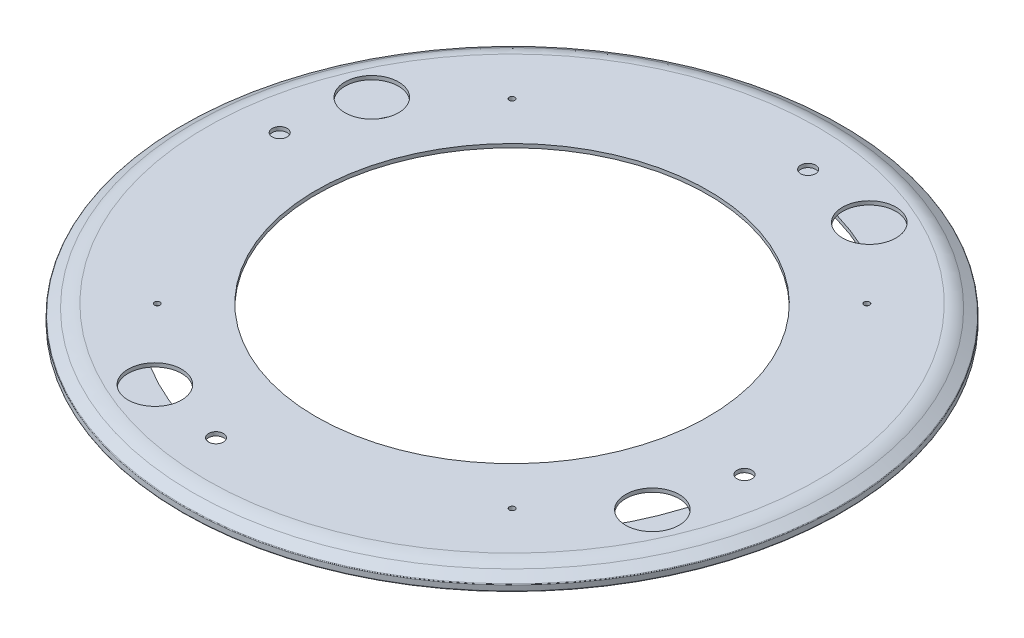
ISO-10303-21;
HEADER;
FILE_DESCRIPTION(('STEP AP214'),'2;1');
FILE_NAME('part.step','',(''),(''),'','','');
FILE_SCHEMA(('AUTOMOTIVE_DESIGN { 1 0 10303 214 1 1 1 1 }'));
ENDSEC;
DATA;
#1=APPLICATION_CONTEXT('core data for automotive mechanical design processes');
#2=APPLICATION_PROTOCOL_DEFINITION('international standard','automotive_design',2000,#1);
#3=PRODUCT_CONTEXT('',#1,'mechanical');
#4=PRODUCT('Part','Part','',(#3));
#5=PRODUCT_RELATED_PRODUCT_CATEGORY('part','',(#4));
#6=PRODUCT_DEFINITION_FORMATION('','',#4);
#7=PRODUCT_DEFINITION_CONTEXT('part definition',#1,'design');
#8=PRODUCT_DEFINITION('design','',#6,#7);
#9=PRODUCT_DEFINITION_SHAPE('','',#8);
#10=(LENGTH_UNIT() NAMED_UNIT(*) SI_UNIT(.MILLI.,.METRE.));
#11=(NAMED_UNIT(*) PLANE_ANGLE_UNIT() SI_UNIT($,.RADIAN.));
#12=(NAMED_UNIT(*) SI_UNIT($,.STERADIAN.) SOLID_ANGLE_UNIT());
#13=UNCERTAINTY_MEASURE_WITH_UNIT(LENGTH_MEASURE(1.E-05),#10,'distance_accuracy_value','');
#14=(GEOMETRIC_REPRESENTATION_CONTEXT(3) GLOBAL_UNCERTAINTY_ASSIGNED_CONTEXT((#13)) GLOBAL_UNIT_ASSIGNED_CONTEXT((#10,
#11,#12)) REPRESENTATION_CONTEXT('',''));
#15=CARTESIAN_POINT('',(0.,0.,0.));
#16=DIRECTION('',(0.,0.,1.));
#17=DIRECTION('',(1.,0.,0.));
#18=AXIS2_PLACEMENT_3D('',#15,#16,#17);
#19=CARTESIAN_POINT('',(0.,0.,0.));
#20=DIRECTION('',(0.,1.,0.));
#21=DIRECTION('',(0.,0.,1.));
#22=AXIS2_PLACEMENT_3D('',#19,#20,#21);
#23=CYLINDRICAL_SURFACE('',#22,140.5);
#24=CARTESIAN_POINT('',(0.,0.,0.));
#25=DIRECTION('',(0.,1.,0.));
#26=DIRECTION('',(0.,0.,1.));
#27=AXIS2_PLACEMENT_3D('',#24,#25,#26);
#28=CIRCLE('',#27,140.5);
#29=CARTESIAN_POINT('',(0.,0.,140.5));
#30=VERTEX_POINT('',#29);
#31=EDGE_CURVE('E108',#30,#30,#28,.T.);
#32=ORIENTED_EDGE('',*,*,#31,.F.);
#33=EDGE_LOOP('',(#32));
#34=FACE_BOUND('',#33,.T.);
#35=CARTESIAN_POINT('',(0.,2.,0.));
#36=DIRECTION('',(0.,1.,0.));
#37=DIRECTION('',(0.,0.,1.));
#38=AXIS2_PLACEMENT_3D('',#35,#36,#37);
#39=CIRCLE('',#38,140.5);
#40=CARTESIAN_POINT('',(0.,2.,140.5));
#41=VERTEX_POINT('',#40);
#42=EDGE_CURVE('E10',#41,#41,#39,.T.);
#43=ORIENTED_EDGE('',*,*,#42,.T.);
#44=EDGE_LOOP('',(#43));
#45=FACE_BOUND('',#44,.T.);
#46=ADVANCED_FACE('F49',(#34,#45),#23,.F.);
#47=CARTESIAN_POINT('',(140.5,2.,0.));
#48=DIRECTION('',(0.,-1.,0.));
#49=DIRECTION('',(0.,0.,-1.));
#50=AXIS2_PLACEMENT_3D('',#47,#48,#49);
#51=PLANE('',#50);
#52=CARTESIAN_POINT('',(-103.5,2.,-103.5));
#53=DIRECTION('',(0.,-1.,0.));
#54=DIRECTION('',(0.,0.,-1.));
#55=AXIS2_PLACEMENT_3D('',#52,#53,#54);
#56=CIRCLE('',#55,2.5);
#57=CARTESIAN_POINT('',(-103.5,2.,-106.));
#58=VERTEX_POINT('',#57);
#59=EDGE_CURVE('E185',#58,#58,#56,.T.);
#60=ORIENTED_EDGE('',*,*,#59,.T.);
#61=EDGE_LOOP('',(#60));
#62=FACE_BOUND('',#61,.T.);
#63=CARTESIAN_POINT('',(103.5,2.,-103.5));
#64=DIRECTION('',(0.,-1.,0.));
#65=DIRECTION('',(0.,0.,-1.));
#66=AXIS2_PLACEMENT_3D('',#63,#64,#65);
#67=CIRCLE('',#66,2.5);
#68=CARTESIAN_POINT('',(103.5,2.,-106.));
#69=VERTEX_POINT('',#68);
#70=EDGE_CURVE('E194',#69,#69,#67,.T.);
#71=ORIENTED_EDGE('',*,*,#70,.T.);
#72=EDGE_LOOP('',(#71));
#73=FACE_BOUND('',#72,.T.);
#74=CARTESIAN_POINT('',(103.5,2.,103.5));
#75=DIRECTION('',(0.,-1.,0.));
#76=DIRECTION('',(0.,0.,-1.));
#77=AXIS2_PLACEMENT_3D('',#74,#75,#76);
#78=CIRCLE('',#77,2.5);
#79=CARTESIAN_POINT('',(103.5,2.,101.));
#80=VERTEX_POINT('',#79);
#81=EDGE_CURVE('E202',#80,#80,#78,.T.);
#82=ORIENTED_EDGE('',*,*,#81,.T.);
#83=EDGE_LOOP('',(#82));
#84=FACE_BOUND('',#83,.T.);
#85=CARTESIAN_POINT('',(-103.5,2.,103.5));
#86=DIRECTION('',(0.,-1.,0.));
#87=DIRECTION('',(0.,0.,-1.));
#88=AXIS2_PLACEMENT_3D('',#85,#86,#87);
#89=CIRCLE('',#88,2.5);
#90=CARTESIAN_POINT('',(-103.5,2.,101.));
#91=VERTEX_POINT('',#90);
#92=EDGE_CURVE('E166',#91,#91,#89,.T.);
#93=ORIENTED_EDGE('',*,*,#92,.T.);
#94=EDGE_LOOP('',(#93));
#95=FACE_BOUND('',#94,.T.);
#96=ORIENTED_EDGE('',*,*,#42,.F.);
#97=EDGE_LOOP('',(#96));
#98=FACE_BOUND('',#97,.T.);
#99=CARTESIAN_POINT('',(0.,2.,0.));
#100=DIRECTION('',(0.,1.,0.));
#101=DIRECTION('',(0.,0.,1.));
#102=AXIS2_PLACEMENT_3D('',#99,#100,#101);
#103=CIRCLE('',#102,174.5);
#104=CARTESIAN_POINT('',(0.,2.,174.5));
#105=VERTEX_POINT('',#104);
#106=EDGE_CURVE('E56',#105,#105,#103,.T.);
#107=ORIENTED_EDGE('',*,*,#106,.T.);
#108=EDGE_LOOP('',(#107));
#109=FACE_BOUND('',#108,.T.);
#110=ADVANCED_FACE('F311',(#62,#73,#84,#95,#98,#109),#51,.F.);
#111=CARTESIAN_POINT('',(0.,0.,0.));
#112=DIRECTION('',(0.,1.,0.));
#113=DIRECTION('',(0.,0.,1.));
#114=AXIS2_PLACEMENT_3D('',#111,#112,#113);
#115=CYLINDRICAL_SURFACE('',#114,174.5);
#116=ORIENTED_EDGE('',*,*,#106,.F.);
#117=EDGE_LOOP('',(#116));
#118=FACE_BOUND('',#117,.T.);
#119=CARTESIAN_POINT('',(0.,2.65641360820091,0.));
#120=DIRECTION('',(0.,1.,0.));
#121=DIRECTION('',(0.,0.,1.));
#122=AXIS2_PLACEMENT_3D('',#119,#120,#121);
#123=CIRCLE('',#122,174.5);
#124=CARTESIAN_POINT('',(0.,2.65641360820091,174.5));
#125=VERTEX_POINT('',#124);
#126=EDGE_CURVE('E61',#125,#125,#123,.T.);
#127=ORIENTED_EDGE('',*,*,#126,.T.);
#128=EDGE_LOOP('',(#127));
#129=FACE_BOUND('',#128,.T.);
#130=ADVANCED_FACE('F315',(#118,#129),#115,.F.);
#131=CARTESIAN_POINT('',(0.,6.4390845528927,0.));
#132=DIRECTION('',(0.,-1.,0.));
#133=DIRECTION('',(0.,0.,-1.));
#134=AXIS2_PLACEMENT_3D('',#131,#132,#133);
#135=CONICAL_SURFACE('',#134,168.096314471535,1.03724151687825);
#136=ORIENTED_EDGE('',*,*,#126,.F.);
#137=EDGE_LOOP('',(#136));
#138=FACE_BOUND('',#137,.T.);
#139=CARTESIAN_POINT('',(0.,6.4390845528927,0.));
#140=DIRECTION('',(0.,1.,0.));
#141=DIRECTION('',(0.,0.,1.));
#142=AXIS2_PLACEMENT_3D('',#139,#140,#141);
#143=CIRCLE('',#142,168.096314471535);
#144=CARTESIAN_POINT('',(0.,6.4390845528927,168.096314471535));
#145=VERTEX_POINT('',#144);
#146=EDGE_CURVE('E66',#145,#145,#143,.T.);
#147=ORIENTED_EDGE('',*,*,#146,.T.);
#148=EDGE_LOOP('',(#147));
#149=FACE_BOUND('',#148,.T.);
#150=ADVANCED_FACE('F320',(#138,#149),#135,.F.);
#151=CARTESIAN_POINT('',(0.,-10.6274641766562,0.));
#152=DIRECTION('',(0.,1.,0.));
#153=DIRECTION('',(0.,0.,1.));
#154=AXIS2_PLACEMENT_3D('',#151,#152,#153);
#155=TOROIDAL_SURFACE('',#154,163.68491925446,17.6274641766562);
#156=ORIENTED_EDGE('',*,*,#146,.F.);
#157=EDGE_LOOP('',(#156));
#158=FACE_BOUND('',#157,.T.);
#159=CARTESIAN_POINT('',(0.,7.,0.));
#160=DIRECTION('',(0.,1.,0.));
#161=DIRECTION('',(0.,0.,1.));
#162=AXIS2_PLACEMENT_3D('',#159,#160,#161);
#163=CIRCLE('',#162,163.68491925446);
#164=CARTESIAN_POINT('',(0.,7.,163.68491925446));
#165=VERTEX_POINT('',#164);
#166=EDGE_CURVE('E72',#165,#165,#163,.T.);
#167=ORIENTED_EDGE('',*,*,#166,.T.);
#168=EDGE_LOOP('',(#167));
#169=FACE_BOUND('',#168,.T.);
#170=ADVANCED_FACE('F327',(#158,#169),#155,.F.);
#171=CARTESIAN_POINT('',(105.,7.,0.));
#172=DIRECTION('',(0.,1.,0.));
#173=DIRECTION('',(0.,0.,1.));
#174=AXIS2_PLACEMENT_3D('',#171,#172,#173);
#175=PLANE('',#174);
#176=CARTESIAN_POINT('',(-95.,7.,95.));
#177=DIRECTION('',(0.,1.,0.));
#178=DIRECTION('',(0.,0.,1.));
#179=AXIS2_PLACEMENT_3D('',#176,#177,#178);
#180=CIRCLE('',#179,1.5);
#181=CARTESIAN_POINT('',(-95.,7.,96.5));
#182=VERTEX_POINT('',#181);
#183=EDGE_CURVE('E190',#182,#182,#180,.T.);
#184=ORIENTED_EDGE('',*,*,#183,.T.);
#185=EDGE_LOOP('',(#184));
#186=FACE_BOUND('',#185,.T.);
#187=CARTESIAN_POINT('',(95.,7.,95.));
#188=DIRECTION('',(0.,1.,0.));
#189=DIRECTION('',(0.,0.,1.));
#190=AXIS2_PLACEMENT_3D('',#187,#188,#189);
#191=CIRCLE('',#190,1.5);
#192=CARTESIAN_POINT('',(95.,7.,96.5));
#193=VERTEX_POINT('',#192);
#194=EDGE_CURVE('E212',#193,#193,#191,.T.);
#195=ORIENTED_EDGE('',*,*,#194,.T.);
#196=EDGE_LOOP('',(#195));
#197=FACE_BOUND('',#196,.T.);
#198=CARTESIAN_POINT('',(95.,7.,-95.));
#199=DIRECTION('',(0.,1.,0.));
#200=DIRECTION('',(0.,0.,1.));
#201=AXIS2_PLACEMENT_3D('',#198,#199,#200);
#202=CIRCLE('',#201,1.5);
#203=CARTESIAN_POINT('',(95.,7.,-93.5));
#204=VERTEX_POINT('',#203);
#205=EDGE_CURVE('E216',#204,#204,#202,.T.);
#206=ORIENTED_EDGE('',*,*,#205,.T.);
#207=EDGE_LOOP('',(#206));
#208=FACE_BOUND('',#207,.T.);
#209=CARTESIAN_POINT('',(-95.,7.,-95.));
#210=DIRECTION('',(0.,1.,0.));
#211=DIRECTION('',(0.,0.,1.));
#212=AXIS2_PLACEMENT_3D('',#209,#210,#211);
#213=CIRCLE('',#212,1.5);
#214=CARTESIAN_POINT('',(-95.,7.,-93.5));
#215=VERTEX_POINT('',#214);
#216=EDGE_CURVE('E220',#215,#215,#213,.T.);
#217=ORIENTED_EDGE('',*,*,#216,.T.);
#218=EDGE_LOOP('',(#217));
#219=FACE_BOUND('',#218,.T.);
#220=CARTESIAN_POINT('',(17.0534925476215,7.,-141.497897624813));
#221=DIRECTION('',(0.,1.,0.));
#222=DIRECTION('',(0.,0.,1.));
#223=AXIS2_PLACEMENT_3D('',#220,#221,#222);
#224=CIRCLE('',#223,3.99999999999332);
#225=CARTESIAN_POINT('',(17.0534925476215,7.,-137.49789762482));
#226=VERTEX_POINT('',#225);
#227=EDGE_CURVE('E134',#226,#226,#224,.T.);
#228=ORIENTED_EDGE('',*,*,#227,.T.);
#229=EDGE_LOOP('',(#228));
#230=FACE_BOUND('',#229,.T.);
#231=CARTESIAN_POINT('',(141.497897624818,7.,17.053492547618));
#232=DIRECTION('',(0.,1.,0.));
#233=DIRECTION('',(0.,0.,1.));
#234=AXIS2_PLACEMENT_3D('',#231,#232,#233);
#235=CIRCLE('',#234,3.99999999999576);
#236=CARTESIAN_POINT('',(141.497897624818,7.,21.0534925476138));
#237=VERTEX_POINT('',#236);
#238=EDGE_CURVE('E148',#237,#237,#235,.T.);
#239=ORIENTED_EDGE('',*,*,#238,.T.);
#240=EDGE_LOOP('',(#239));
#241=FACE_BOUND('',#240,.T.);
#242=CARTESIAN_POINT('',(-17.0534925476135,7.,141.497897624814));
#243=DIRECTION('',(0.,1.,0.));
#244=DIRECTION('',(0.,0.,1.));
#245=AXIS2_PLACEMENT_3D('',#242,#243,#244);
#246=CIRCLE('',#245,4.00000000000157);
#247=CARTESIAN_POINT('',(-17.0534925476135,7.,145.497897624816));
#248=VERTEX_POINT('',#247);
#249=EDGE_CURVE('E152',#248,#248,#246,.T.);
#250=ORIENTED_EDGE('',*,*,#249,.T.);
#251=EDGE_LOOP('',(#250));
#252=FACE_BOUND('',#251,.T.);
#253=CARTESIAN_POINT('',(-141.49789762481,7.,-17.053492547617));
#254=DIRECTION('',(0.,1.,0.));
#255=DIRECTION('',(0.,0.,1.));
#256=AXIS2_PLACEMENT_3D('',#253,#254,#255);
#257=CIRCLE('',#256,4.);
#258=CARTESIAN_POINT('',(-141.49789762481,7.,-13.053492547617));
#259=VERTEX_POINT('',#258);
#260=EDGE_CURVE('E156',#259,#259,#257,.T.);
#261=ORIENTED_EDGE('',*,*,#260,.T.);
#262=EDGE_LOOP('',(#261));
#263=FACE_BOUND('',#262,.T.);
#264=CARTESIAN_POINT('',(58.0816814125634,7.,-133.219094668485));
#265=DIRECTION('',(0.,1.,0.));
#266=DIRECTION('',(0.,0.,1.));
#267=AXIS2_PLACEMENT_3D('',#264,#265,#266);
#268=CIRCLE('',#267,14.3252860119552);
#269=CARTESIAN_POINT('',(58.0816814125634,7.,-118.893808656529));
#270=VERTEX_POINT('',#269);
#271=EDGE_CURVE('E112',#270,#270,#268,.T.);
#272=ORIENTED_EDGE('',*,*,#271,.T.);
#273=EDGE_LOOP('',(#272));
#274=FACE_BOUND('',#273,.T.);
#275=CARTESIAN_POINT('',(133.21909466849,7.,58.0816814125614));
#276=DIRECTION('',(0.,1.,0.));
#277=DIRECTION('',(0.,0.,1.));
#278=AXIS2_PLACEMENT_3D('',#275,#276,#277);
#279=CIRCLE('',#278,14.325286011956);
#280=CARTESIAN_POINT('',(133.21909466849,7.,72.4069674245174));
#281=VERTEX_POINT('',#280);
#282=EDGE_CURVE('E116',#281,#281,#279,.T.);
#283=ORIENTED_EDGE('',*,*,#282,.T.);
#284=EDGE_LOOP('',(#283));
#285=FACE_BOUND('',#284,.T.);
#286=CARTESIAN_POINT('',(-58.081681412556,7.,133.219094668488));
#287=DIRECTION('',(0.,1.,0.));
#288=DIRECTION('',(0.,0.,1.));
#289=AXIS2_PLACEMENT_3D('',#286,#287,#288);
#290=CIRCLE('',#289,14.3252860119621);
#291=CARTESIAN_POINT('',(-58.081681412556,7.,147.54438068045));
#292=VERTEX_POINT('',#291);
#293=EDGE_CURVE('E120',#292,#292,#290,.T.);
#294=ORIENTED_EDGE('',*,*,#293,.T.);
#295=EDGE_LOOP('',(#294));
#296=FACE_BOUND('',#295,.T.);
#297=CARTESIAN_POINT('',(-133.219094668482,7.,-58.081681412558));
#298=DIRECTION('',(0.,1.,0.));
#299=DIRECTION('',(0.,0.,1.));
#300=AXIS2_PLACEMENT_3D('',#297,#298,#299);
#301=CIRCLE('',#300,14.3252860119621);
#302=CARTESIAN_POINT('',(-133.219094668482,7.,-43.7563954005959));
#303=VERTEX_POINT('',#302);
#304=EDGE_CURVE('E124',#303,#303,#301,.T.);
#305=ORIENTED_EDGE('',*,*,#304,.T.);
#306=EDGE_LOOP('',(#305));
#307=FACE_BOUND('',#306,.T.);
#308=ORIENTED_EDGE('',*,*,#166,.F.);
#309=EDGE_LOOP('',(#308));
#310=FACE_BOUND('',#309,.T.);
#311=CARTESIAN_POINT('',(0.,7.,0.));
#312=DIRECTION('',(0.,1.,0.));
#313=DIRECTION('',(0.,0.,1.));
#314=AXIS2_PLACEMENT_3D('',#311,#312,#313);
#315=CIRCLE('',#314,105.);
#316=CARTESIAN_POINT('',(0.,7.,105.));
#317=VERTEX_POINT('',#316);
#318=EDGE_CURVE('E76',#317,#317,#315,.T.);
#319=ORIENTED_EDGE('',*,*,#318,.T.);
#320=EDGE_LOOP('',(#319));
#321=FACE_BOUND('',#320,.T.);
#322=ADVANCED_FACE('F331',(#186,#197,#208,#219,#230,#241,#252,#263,#274,#285,#296,#307,#310,
#321),#175,.F.);
#323=CARTESIAN_POINT('',(0.,0.,0.));
#324=DIRECTION('',(0.,1.,0.));
#325=DIRECTION('',(0.,0.,1.));
#326=AXIS2_PLACEMENT_3D('',#323,#324,#325);
#327=CYLINDRICAL_SURFACE('',#326,105.);
#328=ORIENTED_EDGE('',*,*,#318,.F.);
#329=EDGE_LOOP('',(#328));
#330=FACE_BOUND('',#329,.T.);
#331=CARTESIAN_POINT('',(0.,8.99999999999999,0.));
#332=DIRECTION('',(0.,1.,0.));
#333=DIRECTION('',(0.,0.,1.));
#334=AXIS2_PLACEMENT_3D('',#331,#332,#333);
#335=CIRCLE('',#334,105.);
#336=CARTESIAN_POINT('',(0.,8.99999999999999,105.));
#337=VERTEX_POINT('',#336);
#338=EDGE_CURVE('E80',#337,#337,#335,.T.);
#339=ORIENTED_EDGE('',*,*,#338,.T.);
#340=EDGE_LOOP('',(#339));
#341=FACE_BOUND('',#340,.T.);
#342=ADVANCED_FACE('F248',(#330,#341),#327,.F.);
#343=CARTESIAN_POINT('',(163.68491925446,9.,0.));
#344=DIRECTION('',(0.,-1.,0.));
#345=DIRECTION('',(0.,0.,-1.));
#346=AXIS2_PLACEMENT_3D('',#343,#344,#345);
#347=PLANE('',#346);
#348=CARTESIAN_POINT('',(-95.,9.,95.));
#349=DIRECTION('',(0.,1.,0.));
#350=DIRECTION('',(0.,0.,1.));
#351=AXIS2_PLACEMENT_3D('',#348,#349,#350);
#352=CIRCLE('',#351,1.5);
#353=CARTESIAN_POINT('',(-95.,9.,96.5));
#354=VERTEX_POINT('',#353);
#355=EDGE_CURVE('E229',#354,#354,#352,.T.);
#356=ORIENTED_EDGE('',*,*,#355,.F.);
#357=EDGE_LOOP('',(#356));
#358=FACE_BOUND('',#357,.T.);
#359=CARTESIAN_POINT('',(95.,9.,95.));
#360=DIRECTION('',(0.,1.,0.));
#361=DIRECTION('',(0.,0.,1.));
#362=AXIS2_PLACEMENT_3D('',#359,#360,#361);
#363=CIRCLE('',#362,1.5);
#364=CARTESIAN_POINT('',(95.,9.,96.5));
#365=VERTEX_POINT('',#364);
#366=EDGE_CURVE('E233',#365,#365,#363,.T.);
#367=ORIENTED_EDGE('',*,*,#366,.F.);
#368=EDGE_LOOP('',(#367));
#369=FACE_BOUND('',#368,.T.);
#370=CARTESIAN_POINT('',(95.,9.,-95.));
#371=DIRECTION('',(0.,1.,0.));
#372=DIRECTION('',(0.,0.,1.));
#373=AXIS2_PLACEMENT_3D('',#370,#371,#372);
#374=CIRCLE('',#373,1.5);
#375=CARTESIAN_POINT('',(95.,9.,-93.5));
#376=VERTEX_POINT('',#375);
#377=EDGE_CURVE('E228',#376,#376,#374,.T.);
#378=ORIENTED_EDGE('',*,*,#377,.F.);
#379=EDGE_LOOP('',(#378));
#380=FACE_BOUND('',#379,.T.);
#381=CARTESIAN_POINT('',(-95.,9.,-95.));
#382=DIRECTION('',(0.,1.,0.));
#383=DIRECTION('',(0.,0.,1.));
#384=AXIS2_PLACEMENT_3D('',#381,#382,#383);
#385=CIRCLE('',#384,1.5);
#386=CARTESIAN_POINT('',(-95.,9.,-93.5));
#387=VERTEX_POINT('',#386);
#388=EDGE_CURVE('E224',#387,#387,#385,.T.);
#389=ORIENTED_EDGE('',*,*,#388,.F.);
#390=EDGE_LOOP('',(#389));
#391=FACE_BOUND('',#390,.T.);
#392=CARTESIAN_POINT('',(17.0534925476215,9.,-141.497897624813));
#393=DIRECTION('',(0.,1.,0.));
#394=DIRECTION('',(0.,0.,1.));
#395=AXIS2_PLACEMENT_3D('',#392,#393,#394);
#396=CIRCLE('',#395,3.99999999999332);
#397=CARTESIAN_POINT('',(17.0534925476215,9.,-137.49789762482));
#398=VERTEX_POINT('',#397);
#399=EDGE_CURVE('E160',#398,#398,#396,.T.);
#400=ORIENTED_EDGE('',*,*,#399,.F.);
#401=EDGE_LOOP('',(#400));
#402=FACE_BOUND('',#401,.T.);
#403=CARTESIAN_POINT('',(141.497897624818,9.,17.053492547618));
#404=DIRECTION('',(0.,1.,0.));
#405=DIRECTION('',(0.,0.,1.));
#406=AXIS2_PLACEMENT_3D('',#403,#404,#405);
#407=CIRCLE('',#406,3.99999999999576);
#408=CARTESIAN_POINT('',(141.497897624818,9.,21.0534925476138));
#409=VERTEX_POINT('',#408);
#410=EDGE_CURVE('E170',#409,#409,#407,.T.);
#411=ORIENTED_EDGE('',*,*,#410,.F.);
#412=EDGE_LOOP('',(#411));
#413=FACE_BOUND('',#412,.T.);
#414=CARTESIAN_POINT('',(-17.0534925476135,9.,141.497897624814));
#415=DIRECTION('',(0.,1.,0.));
#416=DIRECTION('',(0.,0.,1.));
#417=AXIS2_PLACEMENT_3D('',#414,#415,#416);
#418=CIRCLE('',#417,4.00000000000157);
#419=CARTESIAN_POINT('',(-17.0534925476135,9.,145.497897624816));
#420=VERTEX_POINT('',#419);
#421=EDGE_CURVE('E165',#420,#420,#418,.T.);
#422=ORIENTED_EDGE('',*,*,#421,.F.);
#423=EDGE_LOOP('',(#422));
#424=FACE_BOUND('',#423,.T.);
#425=CARTESIAN_POINT('',(-141.49789762481,9.,-17.053492547617));
#426=DIRECTION('',(0.,1.,0.));
#427=DIRECTION('',(0.,0.,1.));
#428=AXIS2_PLACEMENT_3D('',#425,#426,#427);
#429=CIRCLE('',#428,4.);
#430=CARTESIAN_POINT('',(-141.49789762481,9.,-13.053492547617));
#431=VERTEX_POINT('',#430);
#432=EDGE_CURVE('E161',#431,#431,#429,.T.);
#433=ORIENTED_EDGE('',*,*,#432,.F.);
#434=EDGE_LOOP('',(#433));
#435=FACE_BOUND('',#434,.T.);
#436=CARTESIAN_POINT('',(58.0816814125634,9.,-133.219094668485));
#437=DIRECTION('',(0.,1.,0.));
#438=DIRECTION('',(0.,0.,1.));
#439=AXIS2_PLACEMENT_3D('',#436,#437,#438);
#440=CIRCLE('',#439,14.3252860119552);
#441=CARTESIAN_POINT('',(58.0816814125634,9.,-118.893808656529));
#442=VERTEX_POINT('',#441);
#443=EDGE_CURVE('E128',#442,#442,#440,.T.);
#444=ORIENTED_EDGE('',*,*,#443,.F.);
#445=EDGE_LOOP('',(#444));
#446=FACE_BOUND('',#445,.T.);
#447=CARTESIAN_POINT('',(133.21909466849,9.,58.0816814125614));
#448=DIRECTION('',(0.,1.,0.));
#449=DIRECTION('',(0.,0.,1.));
#450=AXIS2_PLACEMENT_3D('',#447,#448,#449);
#451=CIRCLE('',#450,14.325286011956);
#452=CARTESIAN_POINT('',(133.21909466849,9.,72.4069674245174));
#453=VERTEX_POINT('',#452);
#454=EDGE_CURVE('E138',#453,#453,#451,.T.);
#455=ORIENTED_EDGE('',*,*,#454,.F.);
#456=EDGE_LOOP('',(#455));
#457=FACE_BOUND('',#456,.T.);
#458=CARTESIAN_POINT('',(-58.081681412556,9.,133.219094668488));
#459=DIRECTION('',(0.,1.,0.));
#460=DIRECTION('',(0.,0.,1.));
#461=AXIS2_PLACEMENT_3D('',#458,#459,#460);
#462=CIRCLE('',#461,14.3252860119621);
#463=CARTESIAN_POINT('',(-58.081681412556,9.,147.54438068045));
#464=VERTEX_POINT('',#463);
#465=EDGE_CURVE('E133',#464,#464,#462,.T.);
#466=ORIENTED_EDGE('',*,*,#465,.F.);
#467=EDGE_LOOP('',(#466));
#468=FACE_BOUND('',#467,.T.);
#469=CARTESIAN_POINT('',(-133.219094668482,9.,-58.081681412558));
#470=DIRECTION('',(0.,1.,0.));
#471=DIRECTION('',(0.,0.,1.));
#472=AXIS2_PLACEMENT_3D('',#469,#470,#471);
#473=CIRCLE('',#472,14.3252860119621);
#474=CARTESIAN_POINT('',(-133.219094668482,9.,-43.7563954005959));
#475=VERTEX_POINT('',#474);
#476=EDGE_CURVE('E129',#475,#475,#473,.T.);
#477=ORIENTED_EDGE('',*,*,#476,.F.);
#478=EDGE_LOOP('',(#477));
#479=FACE_BOUND('',#478,.T.);
#480=ORIENTED_EDGE('',*,*,#338,.F.);
#481=EDGE_LOOP('',(#480));
#482=FACE_BOUND('',#481,.T.);
#483=CARTESIAN_POINT('',(0.,9.,0.));
#484=DIRECTION('',(0.,1.,0.));
#485=DIRECTION('',(0.,0.,1.));
#486=AXIS2_PLACEMENT_3D('',#483,#484,#485);
#487=CIRCLE('',#486,163.68491925446);
#488=CARTESIAN_POINT('',(0.,9.,163.68491925446));
#489=VERTEX_POINT('',#488);
#490=EDGE_CURVE('E84',#489,#489,#487,.T.);
#491=ORIENTED_EDGE('',*,*,#490,.T.);
#492=EDGE_LOOP('',(#491));
#493=FACE_BOUND('',#492,.T.);
#494=ADVANCED_FACE('F244',(#358,#369,#380,#391,#402,#413,#424,#435,#446,#457,#468,#479,#482,
#493),#347,.F.);
#495=CARTESIAN_POINT('',(0.,-4.50747597118616,0.));
#496=DIRECTION('',(0.,1.,0.));
#497=DIRECTION('',(0.,0.,1.));
#498=AXIS2_PLACEMENT_3D('',#495,#496,#497);
#499=TOROIDAL_SURFACE('',#498,163.68491925446,13.5074759711862);
#500=ORIENTED_EDGE('',*,*,#490,.F.);
#501=EDGE_LOOP('',(#500));
#502=FACE_BOUND('',#501,.T.);
#503=CARTESIAN_POINT('',(0.,6.83538685247975,0.));
#504=DIRECTION('',(0.,1.,0.));
#505=DIRECTION('',(0.,0.,1.));
#506=AXIS2_PLACEMENT_3D('',#503,#504,#505);
#507=CIRCLE('',#506,171.019179276826);
#508=CARTESIAN_POINT('',(0.,6.83538685247975,171.019179276826));
#509=VERTEX_POINT('',#508);
#510=EDGE_CURVE('E88',#509,#509,#507,.T.);
#511=ORIENTED_EDGE('',*,*,#510,.T.);
#512=EDGE_LOOP('',(#511));
#513=FACE_BOUND('',#512,.T.);
#514=ADVANCED_FACE('F247',(#502,#513),#499,.T.);
#515=CARTESIAN_POINT('',(0.,3.65870689774832,0.));
#516=DIRECTION('',(0.,-1.,0.));
#517=DIRECTION('',(0.,0.,-1.));
#518=AXIS2_PLACEMENT_3D('',#515,#516,#517);
#519=CONICAL_SURFACE('',#518,176.259204970987,1.0258058557927);
#520=ORIENTED_EDGE('',*,*,#510,.F.);
#521=EDGE_LOOP('',(#520));
#522=FACE_BOUND('',#521,.T.);
#523=CARTESIAN_POINT('',(0.,3.65870689774832,0.));
#524=DIRECTION('',(0.,1.,0.));
#525=DIRECTION('',(0.,0.,1.));
#526=AXIS2_PLACEMENT_3D('',#523,#524,#525);
#527=CIRCLE('',#526,176.259204970987);
#528=CARTESIAN_POINT('',(0.,3.65870689774832,176.259204970987));
#529=VERTEX_POINT('',#528);
#530=EDGE_CURVE('E92',#529,#529,#527,.T.);
#531=ORIENTED_EDGE('',*,*,#530,.T.);
#532=EDGE_LOOP('',(#531));
#533=FACE_BOUND('',#532,.T.);
#534=ADVANCED_FACE('F275',(#522,#533),#519,.T.);
#535=CARTESIAN_POINT('',(0.,3.23114078237505,0.));
#536=DIRECTION('',(0.,1.,0.));
#537=DIRECTION('',(0.,0.,1.));
#538=AXIS2_PLACEMENT_3D('',#535,#536,#537);
#539=TOROIDAL_SURFACE('',#538,176.,0.499999999999994);
#540=ORIENTED_EDGE('',*,*,#530,.F.);
#541=EDGE_LOOP('',(#540));
#542=FACE_BOUND('',#541,.T.);
#543=CARTESIAN_POINT('',(0.,3.23114078237505,0.));
#544=DIRECTION('',(0.,1.,0.));
#545=DIRECTION('',(0.,0.,1.));
#546=AXIS2_PLACEMENT_3D('',#543,#544,#545);
#547=CIRCLE('',#546,176.5);
#548=CARTESIAN_POINT('',(0.,3.23114078237505,176.5));
#549=VERTEX_POINT('',#548);
#550=EDGE_CURVE('E96',#549,#549,#547,.T.);
#551=ORIENTED_EDGE('',*,*,#550,.T.);
#552=EDGE_LOOP('',(#551));
#553=FACE_BOUND('',#552,.T.);
#554=ADVANCED_FACE('F281',(#542,#553),#539,.T.);
#555=CARTESIAN_POINT('',(0.,0.,0.));
#556=DIRECTION('',(0.,1.,0.));
#557=DIRECTION('',(0.,0.,1.));
#558=AXIS2_PLACEMENT_3D('',#555,#556,#557);
#559=CYLINDRICAL_SURFACE('',#558,176.5);
#560=ORIENTED_EDGE('',*,*,#550,.F.);
#561=EDGE_LOOP('',(#560));
#562=FACE_BOUND('',#561,.T.);
#563=CARTESIAN_POINT('',(0.,0.499999999999999,0.));
#564=DIRECTION('',(0.,1.,0.));
#565=DIRECTION('',(0.,0.,1.));
#566=AXIS2_PLACEMENT_3D('',#563,#564,#565);
#567=CIRCLE('',#566,176.5);
#568=CARTESIAN_POINT('',(0.,0.499999999999999,176.5));
#569=VERTEX_POINT('',#568);
#570=EDGE_CURVE('E100',#569,#569,#567,.T.);
#571=ORIENTED_EDGE('',*,*,#570,.T.);
#572=EDGE_LOOP('',(#571));
#573=FACE_BOUND('',#572,.T.);
#574=ADVANCED_FACE('F287',(#562,#573),#559,.T.);
#575=CARTESIAN_POINT('',(0.,0.499999999999999,0.));
#576=DIRECTION('',(0.,1.,0.));
#577=DIRECTION('',(0.,0.,1.));
#578=AXIS2_PLACEMENT_3D('',#575,#576,#577);
#579=TOROIDAL_SURFACE('',#578,176.,0.5);
#580=ORIENTED_EDGE('',*,*,#570,.F.);
#581=EDGE_LOOP('',(#580));
#582=FACE_BOUND('',#581,.T.);
#583=CARTESIAN_POINT('',(0.,0.,0.));
#584=DIRECTION('',(0.,1.,0.));
#585=DIRECTION('',(0.,0.,1.));
#586=AXIS2_PLACEMENT_3D('',#583,#584,#585);
#587=CIRCLE('',#586,176.);
#588=CARTESIAN_POINT('',(0.,0.,176.));
#589=VERTEX_POINT('',#588);
#590=EDGE_CURVE('E104',#589,#589,#587,.T.);
#591=ORIENTED_EDGE('',*,*,#590,.T.);
#592=EDGE_LOOP('',(#591));
#593=FACE_BOUND('',#592,.T.);
#594=ADVANCED_FACE('F293',(#582,#593),#579,.T.);
#595=CARTESIAN_POINT('',(140.5,0.,0.));
#596=DIRECTION('',(0.,1.,0.));
#597=DIRECTION('',(0.,0.,1.));
#598=AXIS2_PLACEMENT_3D('',#595,#596,#597);
#599=PLANE('',#598);
#600=CARTESIAN_POINT('',(-103.5,0.,-103.5));
#601=DIRECTION('',(0.,-1.,0.));
#602=DIRECTION('',(0.,0.,-1.));
#603=AXIS2_PLACEMENT_3D('',#600,#601,#602);
#604=CIRCLE('',#603,2.5);
#605=CARTESIAN_POINT('',(-103.5,0.,-106.));
#606=VERTEX_POINT('',#605);
#607=EDGE_CURVE('E189',#606,#606,#604,.T.);
#608=ORIENTED_EDGE('',*,*,#607,.F.);
#609=EDGE_LOOP('',(#608));
#610=FACE_BOUND('',#609,.T.);
#611=CARTESIAN_POINT('',(103.5,0.,-103.5));
#612=DIRECTION('',(0.,-1.,0.));
#613=DIRECTION('',(0.,0.,-1.));
#614=AXIS2_PLACEMENT_3D('',#611,#612,#613);
#615=CIRCLE('',#614,2.5);
#616=CARTESIAN_POINT('',(103.5,0.,-106.));
#617=VERTEX_POINT('',#616);
#618=EDGE_CURVE('E198',#617,#617,#615,.T.);
#619=ORIENTED_EDGE('',*,*,#618,.F.);
#620=EDGE_LOOP('',(#619));
#621=FACE_BOUND('',#620,.T.);
#622=CARTESIAN_POINT('',(103.5,0.,103.5));
#623=DIRECTION('',(0.,-1.,0.));
#624=DIRECTION('',(0.,0.,-1.));
#625=AXIS2_PLACEMENT_3D('',#622,#623,#624);
#626=CIRCLE('',#625,2.5);
#627=CARTESIAN_POINT('',(103.5,0.,101.));
#628=VERTEX_POINT('',#627);
#629=EDGE_CURVE('E181',#628,#628,#626,.T.);
#630=ORIENTED_EDGE('',*,*,#629,.F.);
#631=EDGE_LOOP('',(#630));
#632=FACE_BOUND('',#631,.T.);
#633=CARTESIAN_POINT('',(-103.5,0.,103.5));
#634=DIRECTION('',(0.,-1.,0.));
#635=DIRECTION('',(0.,0.,-1.));
#636=AXIS2_PLACEMENT_3D('',#633,#634,#635);
#637=CIRCLE('',#636,2.5);
#638=CARTESIAN_POINT('',(-103.5,0.,101.));
#639=VERTEX_POINT('',#638);
#640=EDGE_CURVE('E177',#639,#639,#637,.T.);
#641=ORIENTED_EDGE('',*,*,#640,.F.);
#642=EDGE_LOOP('',(#641));
#643=FACE_BOUND('',#642,.T.);
#644=ORIENTED_EDGE('',*,*,#590,.F.);
#645=EDGE_LOOP('',(#644));
#646=FACE_BOUND('',#645,.T.);
#647=ORIENTED_EDGE('',*,*,#31,.T.);
#648=EDGE_LOOP('',(#647));
#649=FACE_BOUND('',#648,.T.);
#650=ADVANCED_FACE('F299',(#610,#621,#632,#643,#646,#649),#599,.F.);
#651=CARTESIAN_POINT('',(-133.219094668482,6.,-58.081681412558));
#652=DIRECTION('',(0.,1.,0.));
#653=DIRECTION('',(0.,0.,1.));
#654=AXIS2_PLACEMENT_3D('',#651,#652,#653);
#655=CYLINDRICAL_SURFACE('',#654,14.3252860119621);
#656=ORIENTED_EDGE('',*,*,#476,.T.);
#657=EDGE_LOOP('',(#656));
#658=FACE_BOUND('',#657,.T.);
#659=ORIENTED_EDGE('',*,*,#304,.F.);
#660=EDGE_LOOP('',(#659));
#661=FACE_BOUND('',#660,.T.);
#662=ADVANCED_FACE('F305',(#658,#661),#655,.F.);
#663=CARTESIAN_POINT('',(-58.081681412556,6.,133.219094668488));
#664=DIRECTION('',(0.,1.,0.));
#665=DIRECTION('',(0.,0.,1.));
#666=AXIS2_PLACEMENT_3D('',#663,#664,#665);
#667=CYLINDRICAL_SURFACE('',#666,14.3252860119621);
#668=ORIENTED_EDGE('',*,*,#465,.T.);
#669=EDGE_LOOP('',(#668));
#670=FACE_BOUND('',#669,.T.);
#671=ORIENTED_EDGE('',*,*,#293,.F.);
#672=EDGE_LOOP('',(#671));
#673=FACE_BOUND('',#672,.T.);
#674=ADVANCED_FACE('F341',(#670,#673),#667,.F.);
#675=CARTESIAN_POINT('',(133.21909466849,6.,58.0816814125614));
#676=DIRECTION('',(0.,1.,0.));
#677=DIRECTION('',(0.,0.,1.));
#678=AXIS2_PLACEMENT_3D('',#675,#676,#677);
#679=CYLINDRICAL_SURFACE('',#678,14.325286011956);
#680=ORIENTED_EDGE('',*,*,#454,.T.);
#681=EDGE_LOOP('',(#680));
#682=FACE_BOUND('',#681,.T.);
#683=ORIENTED_EDGE('',*,*,#282,.F.);
#684=EDGE_LOOP('',(#683));
#685=FACE_BOUND('',#684,.T.);
#686=ADVANCED_FACE('F345',(#682,#685),#679,.F.);
#687=CARTESIAN_POINT('',(58.0816814125634,6.,-133.219094668485));
#688=DIRECTION('',(0.,1.,0.));
#689=DIRECTION('',(0.,0.,1.));
#690=AXIS2_PLACEMENT_3D('',#687,#688,#689);
#691=CYLINDRICAL_SURFACE('',#690,14.3252860119552);
#692=ORIENTED_EDGE('',*,*,#443,.T.);
#693=EDGE_LOOP('',(#692));
#694=FACE_BOUND('',#693,.T.);
#695=ORIENTED_EDGE('',*,*,#271,.F.);
#696=EDGE_LOOP('',(#695));
#697=FACE_BOUND('',#696,.T.);
#698=ADVANCED_FACE('F349',(#694,#697),#691,.F.);
#699=CARTESIAN_POINT('',(-141.49789762481,6.,-17.053492547617));
#700=DIRECTION('',(0.,1.,0.));
#701=DIRECTION('',(0.,0.,1.));
#702=AXIS2_PLACEMENT_3D('',#699,#700,#701);
#703=CYLINDRICAL_SURFACE('',#702,4.);
#704=ORIENTED_EDGE('',*,*,#432,.T.);
#705=EDGE_LOOP('',(#704));
#706=FACE_BOUND('',#705,.T.);
#707=ORIENTED_EDGE('',*,*,#260,.F.);
#708=EDGE_LOOP('',(#707));
#709=FACE_BOUND('',#708,.T.);
#710=ADVANCED_FACE('F353',(#706,#709),#703,.F.);
#711=CARTESIAN_POINT('',(-17.0534925476135,6.,141.497897624814));
#712=DIRECTION('',(0.,1.,0.));
#713=DIRECTION('',(0.,0.,1.));
#714=AXIS2_PLACEMENT_3D('',#711,#712,#713);
#715=CYLINDRICAL_SURFACE('',#714,4.00000000000157);
#716=ORIENTED_EDGE('',*,*,#421,.T.);
#717=EDGE_LOOP('',(#716));
#718=FACE_BOUND('',#717,.T.);
#719=ORIENTED_EDGE('',*,*,#249,.F.);
#720=EDGE_LOOP('',(#719));
#721=FACE_BOUND('',#720,.T.);
#722=ADVANCED_FACE('F357',(#718,#721),#715,.F.);
#723=CARTESIAN_POINT('',(141.497897624818,6.,17.053492547618));
#724=DIRECTION('',(0.,1.,0.));
#725=DIRECTION('',(0.,0.,1.));
#726=AXIS2_PLACEMENT_3D('',#723,#724,#725);
#727=CYLINDRICAL_SURFACE('',#726,3.99999999999576);
#728=ORIENTED_EDGE('',*,*,#410,.T.);
#729=EDGE_LOOP('',(#728));
#730=FACE_BOUND('',#729,.T.);
#731=ORIENTED_EDGE('',*,*,#238,.F.);
#732=EDGE_LOOP('',(#731));
#733=FACE_BOUND('',#732,.T.);
#734=ADVANCED_FACE('F361',(#730,#733),#727,.F.);
#735=CARTESIAN_POINT('',(17.0534925476215,6.,-141.497897624813));
#736=DIRECTION('',(0.,1.,0.));
#737=DIRECTION('',(0.,0.,1.));
#738=AXIS2_PLACEMENT_3D('',#735,#736,#737);
#739=CYLINDRICAL_SURFACE('',#738,3.99999999999332);
#740=ORIENTED_EDGE('',*,*,#399,.T.);
#741=EDGE_LOOP('',(#740));
#742=FACE_BOUND('',#741,.T.);
#743=ORIENTED_EDGE('',*,*,#227,.F.);
#744=EDGE_LOOP('',(#743));
#745=FACE_BOUND('',#744,.T.);
#746=ADVANCED_FACE('F365',(#742,#745),#739,.F.);
#747=CARTESIAN_POINT('',(-103.5,2.,103.5));
#748=DIRECTION('',(0.,-1.,0.));
#749=DIRECTION('',(0.,0.,-1.));
#750=AXIS2_PLACEMENT_3D('',#747,#748,#749);
#751=CYLINDRICAL_SURFACE('',#750,2.5);
#752=ORIENTED_EDGE('',*,*,#92,.F.);
#753=EDGE_LOOP('',(#752));
#754=FACE_BOUND('',#753,.T.);
#755=ORIENTED_EDGE('',*,*,#640,.T.);
#756=EDGE_LOOP('',(#755));
#757=FACE_BOUND('',#756,.T.);
#758=ADVANCED_FACE('F369',(#754,#757),#751,.F.);
#759=CARTESIAN_POINT('',(103.5,2.,103.5));
#760=DIRECTION('',(0.,-1.,0.));
#761=DIRECTION('',(0.,0.,-1.));
#762=AXIS2_PLACEMENT_3D('',#759,#760,#761);
#763=CYLINDRICAL_SURFACE('',#762,2.5);
#764=ORIENTED_EDGE('',*,*,#81,.F.);
#765=EDGE_LOOP('',(#764));
#766=FACE_BOUND('',#765,.T.);
#767=ORIENTED_EDGE('',*,*,#629,.T.);
#768=EDGE_LOOP('',(#767));
#769=FACE_BOUND('',#768,.T.);
#770=ADVANCED_FACE('F373',(#766,#769),#763,.F.);
#771=CARTESIAN_POINT('',(103.5,2.,-103.5));
#772=DIRECTION('',(0.,-1.,0.));
#773=DIRECTION('',(0.,0.,-1.));
#774=AXIS2_PLACEMENT_3D('',#771,#772,#773);
#775=CYLINDRICAL_SURFACE('',#774,2.5);
#776=ORIENTED_EDGE('',*,*,#70,.F.);
#777=EDGE_LOOP('',(#776));
#778=FACE_BOUND('',#777,.T.);
#779=ORIENTED_EDGE('',*,*,#618,.T.);
#780=EDGE_LOOP('',(#779));
#781=FACE_BOUND('',#780,.T.);
#782=ADVANCED_FACE('F379',(#778,#781),#775,.F.);
#783=CARTESIAN_POINT('',(-103.5,2.,-103.5));
#784=DIRECTION('',(0.,-1.,0.));
#785=DIRECTION('',(0.,0.,-1.));
#786=AXIS2_PLACEMENT_3D('',#783,#784,#785);
#787=CYLINDRICAL_SURFACE('',#786,2.5);
#788=ORIENTED_EDGE('',*,*,#59,.F.);
#789=EDGE_LOOP('',(#788));
#790=FACE_BOUND('',#789,.T.);
#791=ORIENTED_EDGE('',*,*,#607,.T.);
#792=EDGE_LOOP('',(#791));
#793=FACE_BOUND('',#792,.T.);
#794=ADVANCED_FACE('F375',(#790,#793),#787,.F.);
#795=CARTESIAN_POINT('',(-95.,6.,-95.));
#796=DIRECTION('',(0.,1.,0.));
#797=DIRECTION('',(0.,0.,1.));
#798=AXIS2_PLACEMENT_3D('',#795,#796,#797);
#799=CYLINDRICAL_SURFACE('',#798,1.5);
#800=ORIENTED_EDGE('',*,*,#388,.T.);
#801=EDGE_LOOP('',(#800));
#802=FACE_BOUND('',#801,.T.);
#803=ORIENTED_EDGE('',*,*,#216,.F.);
#804=EDGE_LOOP('',(#803));
#805=FACE_BOUND('',#804,.T.);
#806=ADVANCED_FACE('F378',(#802,#805),#799,.F.);
#807=CARTESIAN_POINT('',(95.,6.,-95.));
#808=DIRECTION('',(0.,1.,0.));
#809=DIRECTION('',(0.,0.,1.));
#810=AXIS2_PLACEMENT_3D('',#807,#808,#809);
#811=CYLINDRICAL_SURFACE('',#810,1.5);
#812=ORIENTED_EDGE('',*,*,#377,.T.);
#813=EDGE_LOOP('',(#812));
#814=FACE_BOUND('',#813,.T.);
#815=ORIENTED_EDGE('',*,*,#205,.F.);
#816=EDGE_LOOP('',(#815));
#817=FACE_BOUND('',#816,.T.);
#818=ADVANCED_FACE('F241',(#814,#817),#811,.F.);
#819=CARTESIAN_POINT('',(95.,6.,95.));
#820=DIRECTION('',(0.,1.,0.));
#821=DIRECTION('',(0.,0.,1.));
#822=AXIS2_PLACEMENT_3D('',#819,#820,#821);
#823=CYLINDRICAL_SURFACE('',#822,1.5);
#824=ORIENTED_EDGE('',*,*,#366,.T.);
#825=EDGE_LOOP('',(#824));
#826=FACE_BOUND('',#825,.T.);
#827=ORIENTED_EDGE('',*,*,#194,.F.);
#828=EDGE_LOOP('',(#827));
#829=FACE_BOUND('',#828,.T.);
#830=ADVANCED_FACE('F393',(#826,#829),#823,.F.);
#831=CARTESIAN_POINT('',(-95.,6.,95.));
#832=DIRECTION('',(0.,1.,0.));
#833=DIRECTION('',(0.,0.,1.));
#834=AXIS2_PLACEMENT_3D('',#831,#832,#833);
#835=CYLINDRICAL_SURFACE('',#834,1.5);
#836=ORIENTED_EDGE('',*,*,#355,.T.);
#837=EDGE_LOOP('',(#836));
#838=FACE_BOUND('',#837,.T.);
#839=ORIENTED_EDGE('',*,*,#183,.F.);
#840=EDGE_LOOP('',(#839));
#841=FACE_BOUND('',#840,.T.);
#842=ADVANCED_FACE('F390',(#838,#841),#835,.F.);
#843=CLOSED_SHELL('',(#46,#110,#130,#150,#170,#322,#342,#494,#514,#534,#554,#574,#594,#650,#662,
#674,#686,#698,#710,#722,#734,#746,#758,#770,#782,#794,#806,#818,#830,#842));
#844=MANIFOLD_SOLID_BREP('B2',#843);
#845=ADVANCED_BREP_SHAPE_REPRESENTATION('',(#18,#844),#14);
#846=SHAPE_DEFINITION_REPRESENTATION(#9,#845);
ENDSEC;
END-ISO-10303-21;
